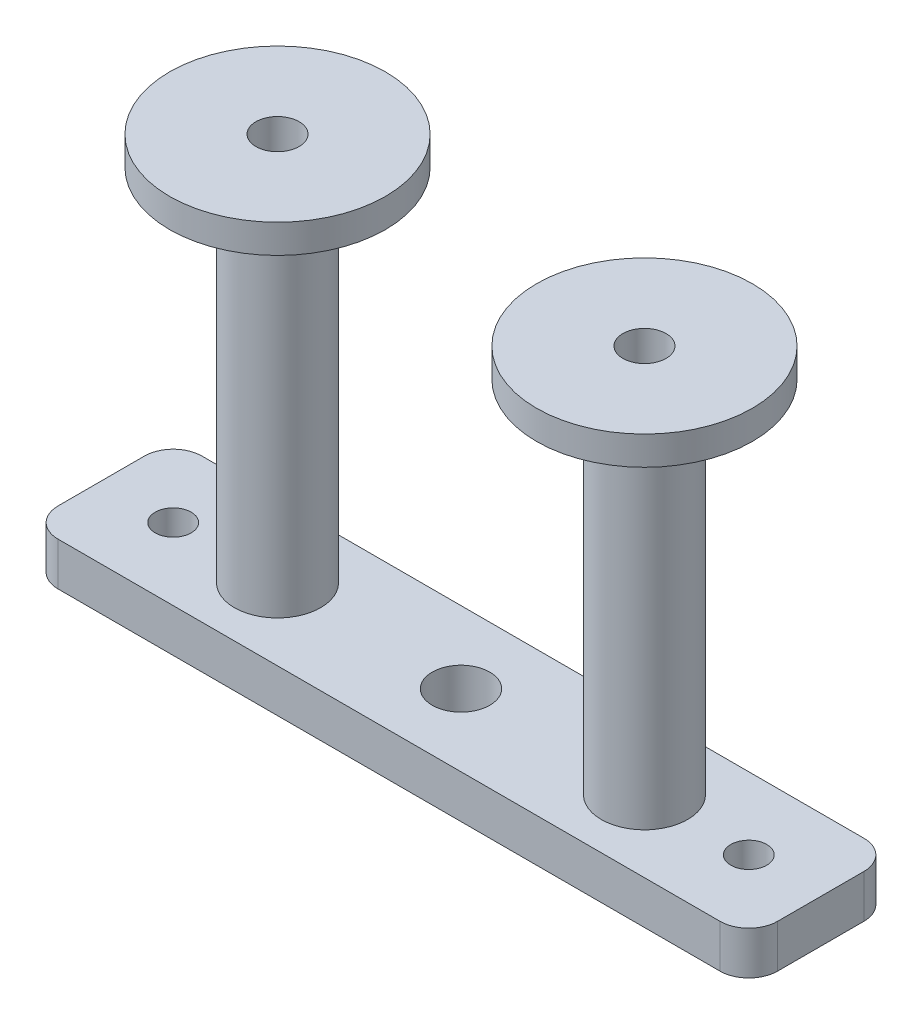
ISO-10303-21;
HEADER;
FILE_DESCRIPTION(('STEP AP214'),'2;1');
FILE_NAME('part.step','',(''),(''),'','','');
FILE_SCHEMA(('AUTOMOTIVE_DESIGN { 1 0 10303 214 1 1 1 1 }'));
ENDSEC;
DATA;
#1=APPLICATION_CONTEXT('core data for automotive mechanical design processes');
#2=APPLICATION_PROTOCOL_DEFINITION('international standard','automotive_design',2000,#1);
#3=PRODUCT_CONTEXT('',#1,'mechanical');
#4=PRODUCT('Part','Part','',(#3));
#5=PRODUCT_RELATED_PRODUCT_CATEGORY('part','',(#4));
#6=PRODUCT_DEFINITION_FORMATION('','',#4);
#7=PRODUCT_DEFINITION_CONTEXT('part definition',#1,'design');
#8=PRODUCT_DEFINITION('design','',#6,#7);
#9=PRODUCT_DEFINITION_SHAPE('','',#8);
#10=(LENGTH_UNIT() NAMED_UNIT(*) SI_UNIT(.MILLI.,.METRE.));
#11=(NAMED_UNIT(*) PLANE_ANGLE_UNIT() SI_UNIT($,.RADIAN.));
#12=(NAMED_UNIT(*) SI_UNIT($,.STERADIAN.) SOLID_ANGLE_UNIT());
#13=UNCERTAINTY_MEASURE_WITH_UNIT(LENGTH_MEASURE(1.E-05),#10,'distance_accuracy_value','');
#14=(GEOMETRIC_REPRESENTATION_CONTEXT(3) GLOBAL_UNCERTAINTY_ASSIGNED_CONTEXT((#13)) GLOBAL_UNIT_ASSIGNED_CONTEXT((#10,
#11,#12)) REPRESENTATION_CONTEXT('',''));
#15=CARTESIAN_POINT('',(0.,0.,0.));
#16=DIRECTION('',(0.,0.,1.));
#17=DIRECTION('',(1.,0.,0.));
#18=AXIS2_PLACEMENT_3D('',#15,#16,#17);
#19=CARTESIAN_POINT('',(2.,3.,-2.));
#20=DIRECTION('',(0.,-1.,0.));
#21=DIRECTION('',(0.,0.,-1.));
#22=AXIS2_PLACEMENT_3D('',#19,#20,#21);
#23=CYLINDRICAL_SURFACE('',#22,2.);
#24=CARTESIAN_POINT('',(2.,0.,-2.));
#25=DIRECTION('',(0.,1.,0.));
#26=DIRECTION('',(0.,0.,1.));
#27=AXIS2_PLACEMENT_3D('',#24,#25,#26);
#28=CIRCLE('',#27,2.);
#29=CARTESIAN_POINT('',(0.,0.,-2.00000000000001));
#30=VERTEX_POINT('',#29);
#31=CARTESIAN_POINT('',(2.00000000000001,0.,0.));
#32=VERTEX_POINT('',#31);
#33=EDGE_CURVE('E138',#30,#32,#28,.T.);
#34=ORIENTED_EDGE('',*,*,#33,.T.);
#35=DIRECTION('',(0.,-1.,0.));
#36=VECTOR('',#35,1.);
#37=CARTESIAN_POINT('',(2.00000000000001,3.,0.));
#38=LINE('',#37,#36);
#39=CARTESIAN_POINT('',(2.00000000000001,3.,0.));
#40=VERTEX_POINT('',#39);
#41=EDGE_CURVE('E12',#40,#32,#38,.T.);
#42=ORIENTED_EDGE('',*,*,#41,.F.);
#43=CARTESIAN_POINT('',(2.,3.,-2.));
#44=DIRECTION('',(0.,1.,0.));
#45=DIRECTION('',(0.,0.,1.));
#46=AXIS2_PLACEMENT_3D('',#43,#44,#45);
#47=CIRCLE('',#46,2.);
#48=CARTESIAN_POINT('',(0.,3.,-2.00000000000001));
#49=VERTEX_POINT('',#48);
#50=EDGE_CURVE('E153',#49,#40,#47,.T.);
#51=ORIENTED_EDGE('',*,*,#50,.F.);
#52=DIRECTION('',(0.,-1.,0.));
#53=VECTOR('',#52,1.);
#54=CARTESIAN_POINT('',(0.,3.,-2.00000000000001));
#55=LINE('',#54,#53);
#56=EDGE_CURVE('E134',#49,#30,#55,.T.);
#57=ORIENTED_EDGE('',*,*,#56,.T.);
#58=EDGE_LOOP('',(#34,#42,#51,#57));
#59=FACE_BOUND('',#58,.T.);
#60=ADVANCED_FACE('F42',(#59),#23,.T.);
#61=CARTESIAN_POINT('',(2.00000000000001,3.,0.));
#62=DIRECTION('',(0.,0.,-1.));
#63=DIRECTION('',(-1.,0.,0.));
#64=AXIS2_PLACEMENT_3D('',#61,#62,#63);
#65=PLANE('',#64);
#66=DIRECTION('',(1.,0.,0.));
#67=VECTOR('',#66,1.);
#68=CARTESIAN_POINT('',(2.00000000000001,0.,0.));
#69=LINE('',#68,#67);
#70=CARTESIAN_POINT('',(48.,0.,0.));
#71=VERTEX_POINT('',#70);
#72=EDGE_CURVE('E141',#32,#71,#69,.T.);
#73=ORIENTED_EDGE('',*,*,#72,.T.);
#74=DIRECTION('',(0.,-1.,0.));
#75=VECTOR('',#74,1.);
#76=CARTESIAN_POINT('',(48.,3.,0.));
#77=LINE('',#76,#75);
#78=CARTESIAN_POINT('',(48.,3.,0.));
#79=VERTEX_POINT('',#78);
#80=EDGE_CURVE('E50',#79,#71,#77,.T.);
#81=ORIENTED_EDGE('',*,*,#80,.F.);
#82=DIRECTION('',(1.,0.,0.));
#83=VECTOR('',#82,1.);
#84=CARTESIAN_POINT('',(2.00000000000001,3.,0.));
#85=LINE('',#84,#83);
#86=EDGE_CURVE('E101',#40,#79,#85,.T.);
#87=ORIENTED_EDGE('',*,*,#86,.F.);
#88=ORIENTED_EDGE('',*,*,#41,.T.);
#89=EDGE_LOOP('',(#73,#81,#87,#88));
#90=FACE_BOUND('',#89,.T.);
#91=ADVANCED_FACE('F272',(#90),#65,.F.);
#92=CARTESIAN_POINT('',(48.,3.,-2.));
#93=DIRECTION('',(0.,-1.,0.));
#94=DIRECTION('',(0.,0.,-1.));
#95=AXIS2_PLACEMENT_3D('',#92,#93,#94);
#96=CYLINDRICAL_SURFACE('',#95,2.);
#97=CARTESIAN_POINT('',(48.,0.,-2.));
#98=DIRECTION('',(0.,1.,0.));
#99=DIRECTION('',(0.,0.,1.));
#100=AXIS2_PLACEMENT_3D('',#97,#98,#99);
#101=CIRCLE('',#100,2.);
#102=CARTESIAN_POINT('',(50.,0.,-2.00000000000001));
#103=VERTEX_POINT('',#102);
#104=EDGE_CURVE('E144',#71,#103,#101,.T.);
#105=ORIENTED_EDGE('',*,*,#104,.T.);
#106=DIRECTION('',(0.,-1.,0.));
#107=VECTOR('',#106,1.);
#108=CARTESIAN_POINT('',(50.,3.,-2.00000000000001));
#109=LINE('',#108,#107);
#110=CARTESIAN_POINT('',(50.,3.,-2.00000000000001));
#111=VERTEX_POINT('',#110);
#112=EDGE_CURVE('E160',#111,#103,#109,.T.);
#113=ORIENTED_EDGE('',*,*,#112,.F.);
#114=CARTESIAN_POINT('',(48.,3.,-2.));
#115=DIRECTION('',(0.,1.,0.));
#116=DIRECTION('',(0.,0.,1.));
#117=AXIS2_PLACEMENT_3D('',#114,#115,#116);
#118=CIRCLE('',#117,2.);
#119=EDGE_CURVE('E168',#79,#111,#118,.T.);
#120=ORIENTED_EDGE('',*,*,#119,.F.);
#121=ORIENTED_EDGE('',*,*,#80,.T.);
#122=EDGE_LOOP('',(#105,#113,#120,#121));
#123=FACE_BOUND('',#122,.T.);
#124=ADVANCED_FACE('F166',(#123),#96,.T.);
#125=CARTESIAN_POINT('',(50.,3.,-2.00000000000001));
#126=DIRECTION('',(-1.,0.,0.));
#127=DIRECTION('',(0.,0.,1.));
#128=AXIS2_PLACEMENT_3D('',#125,#126,#127);
#129=PLANE('',#128);
#130=DIRECTION('',(0.,0.,-1.));
#131=VECTOR('',#130,1.);
#132=CARTESIAN_POINT('',(50.,0.,-2.00000000000001));
#133=LINE('',#132,#131);
#134=CARTESIAN_POINT('',(50.,0.,-7.99999999999999));
#135=VERTEX_POINT('',#134);
#136=EDGE_CURVE('E146',#103,#135,#133,.T.);
#137=ORIENTED_EDGE('',*,*,#136,.T.);
#138=DIRECTION('',(0.,-1.,0.));
#139=VECTOR('',#138,1.);
#140=CARTESIAN_POINT('',(50.,3.,-7.99999999999999));
#141=LINE('',#140,#139);
#142=CARTESIAN_POINT('',(50.,3.,-7.99999999999999));
#143=VERTEX_POINT('',#142);
#144=EDGE_CURVE('E157',#143,#135,#141,.T.);
#145=ORIENTED_EDGE('',*,*,#144,.F.);
#146=DIRECTION('',(0.,0.,-1.));
#147=VECTOR('',#146,1.);
#148=CARTESIAN_POINT('',(50.,3.,-2.00000000000001));
#149=LINE('',#148,#147);
#150=EDGE_CURVE('E180',#111,#143,#149,.T.);
#151=ORIENTED_EDGE('',*,*,#150,.F.);
#152=ORIENTED_EDGE('',*,*,#112,.T.);
#153=EDGE_LOOP('',(#137,#145,#151,#152));
#154=FACE_BOUND('',#153,.T.);
#155=ADVANCED_FACE('F176',(#154),#129,.F.);
#156=CARTESIAN_POINT('',(48.,3.,-8.));
#157=DIRECTION('',(0.,-1.,0.));
#158=DIRECTION('',(0.,0.,-1.));
#159=AXIS2_PLACEMENT_3D('',#156,#157,#158);
#160=CYLINDRICAL_SURFACE('',#159,2.);
#161=CARTESIAN_POINT('',(48.,0.,-8.));
#162=DIRECTION('',(0.,1.,0.));
#163=DIRECTION('',(0.,0.,-1.));
#164=AXIS2_PLACEMENT_3D('',#161,#162,#163);
#165=CIRCLE('',#164,2.);
#166=CARTESIAN_POINT('',(48.,0.,-10.));
#167=VERTEX_POINT('',#166);
#168=EDGE_CURVE('E148',#135,#167,#165,.T.);
#169=ORIENTED_EDGE('',*,*,#168,.T.);
#170=DIRECTION('',(0.,-1.,0.));
#171=VECTOR('',#170,1.);
#172=CARTESIAN_POINT('',(48.,3.,-10.));
#173=LINE('',#172,#171);
#174=CARTESIAN_POINT('',(48.,3.,-10.));
#175=VERTEX_POINT('',#174);
#176=EDGE_CURVE('E129',#175,#167,#173,.T.);
#177=ORIENTED_EDGE('',*,*,#176,.F.);
#178=CARTESIAN_POINT('',(48.,3.,-8.));
#179=DIRECTION('',(0.,1.,0.));
#180=DIRECTION('',(0.,0.,-1.));
#181=AXIS2_PLACEMENT_3D('',#178,#179,#180);
#182=CIRCLE('',#181,2.);
#183=EDGE_CURVE('E120',#143,#175,#182,.T.);
#184=ORIENTED_EDGE('',*,*,#183,.F.);
#185=ORIENTED_EDGE('',*,*,#144,.T.);
#186=EDGE_LOOP('',(#169,#177,#184,#185));
#187=FACE_BOUND('',#186,.T.);
#188=ADVANCED_FACE('F179',(#187),#160,.T.);
#189=CARTESIAN_POINT('',(2.00000000000001,3.,-10.));
#190=DIRECTION('',(0.,0.,1.));
#191=DIRECTION('',(1.,0.,0.));
#192=AXIS2_PLACEMENT_3D('',#189,#190,#191);
#193=PLANE('',#192);
#194=DIRECTION('',(-1.,0.,0.));
#195=VECTOR('',#194,1.);
#196=CARTESIAN_POINT('',(2.00000000000001,0.,-10.));
#197=LINE('',#196,#195);
#198=CARTESIAN_POINT('',(2.00000000000001,0.,-10.));
#199=VERTEX_POINT('',#198);
#200=EDGE_CURVE('E128',#167,#199,#197,.T.);
#201=ORIENTED_EDGE('',*,*,#200,.T.);
#202=DIRECTION('',(0.,-1.,0.));
#203=VECTOR('',#202,1.);
#204=CARTESIAN_POINT('',(2.00000000000001,3.,-10.));
#205=LINE('',#204,#203);
#206=CARTESIAN_POINT('',(2.00000000000001,3.,-10.));
#207=VERTEX_POINT('',#206);
#208=EDGE_CURVE('E125',#207,#199,#205,.T.);
#209=ORIENTED_EDGE('',*,*,#208,.F.);
#210=DIRECTION('',(-1.,0.,0.));
#211=VECTOR('',#210,1.);
#212=CARTESIAN_POINT('',(2.00000000000001,3.,-10.));
#213=LINE('',#212,#211);
#214=EDGE_CURVE('E114',#175,#207,#213,.T.);
#215=ORIENTED_EDGE('',*,*,#214,.F.);
#216=ORIENTED_EDGE('',*,*,#176,.T.);
#217=EDGE_LOOP('',(#201,#209,#215,#216));
#218=FACE_BOUND('',#217,.T.);
#219=ADVANCED_FACE('F126',(#218),#193,.F.);
#220=CARTESIAN_POINT('',(2.,3.,-8.));
#221=DIRECTION('',(0.,-1.,0.));
#222=DIRECTION('',(0.,0.,-1.));
#223=AXIS2_PLACEMENT_3D('',#220,#221,#222);
#224=CYLINDRICAL_SURFACE('',#223,2.);
#225=CARTESIAN_POINT('',(2.,0.,-8.));
#226=DIRECTION('',(0.,1.,0.));
#227=DIRECTION('',(0.,0.,1.));
#228=AXIS2_PLACEMENT_3D('',#225,#226,#227);
#229=CIRCLE('',#228,2.);
#230=CARTESIAN_POINT('',(0.,0.,-7.99999999999999));
#231=VERTEX_POINT('',#230);
#232=EDGE_CURVE('E87',#199,#231,#229,.T.);
#233=ORIENTED_EDGE('',*,*,#232,.T.);
#234=DIRECTION('',(0.,-1.,0.));
#235=VECTOR('',#234,1.);
#236=CARTESIAN_POINT('',(0.,3.,-7.99999999999999));
#237=LINE('',#236,#235);
#238=CARTESIAN_POINT('',(0.,3.,-7.99999999999999));
#239=VERTEX_POINT('',#238);
#240=EDGE_CURVE('E130',#239,#231,#237,.T.);
#241=ORIENTED_EDGE('',*,*,#240,.F.);
#242=CARTESIAN_POINT('',(2.,3.,-8.));
#243=DIRECTION('',(0.,1.,0.));
#244=DIRECTION('',(0.,0.,1.));
#245=AXIS2_PLACEMENT_3D('',#242,#243,#244);
#246=CIRCLE('',#245,2.);
#247=EDGE_CURVE('E118',#207,#239,#246,.T.);
#248=ORIENTED_EDGE('',*,*,#247,.F.);
#249=ORIENTED_EDGE('',*,*,#208,.T.);
#250=EDGE_LOOP('',(#233,#241,#248,#249));
#251=FACE_BOUND('',#250,.T.);
#252=ADVANCED_FACE('F132',(#251),#224,.T.);
#253=CARTESIAN_POINT('',(0.,3.,-2.00000000000001));
#254=DIRECTION('',(1.,0.,0.));
#255=DIRECTION('',(0.,0.,-1.));
#256=AXIS2_PLACEMENT_3D('',#253,#254,#255);
#257=PLANE('',#256);
#258=DIRECTION('',(0.,0.,1.));
#259=VECTOR('',#258,1.);
#260=CARTESIAN_POINT('',(0.,0.,-2.00000000000001));
#261=LINE('',#260,#259);
#262=EDGE_CURVE('E93',#231,#30,#261,.T.);
#263=ORIENTED_EDGE('',*,*,#262,.T.);
#264=ORIENTED_EDGE('',*,*,#56,.F.);
#265=DIRECTION('',(0.,0.,1.));
#266=VECTOR('',#265,1.);
#267=CARTESIAN_POINT('',(0.,3.,-2.00000000000001));
#268=LINE('',#267,#266);
#269=EDGE_CURVE('E58',#239,#49,#268,.T.);
#270=ORIENTED_EDGE('',*,*,#269,.F.);
#271=ORIENTED_EDGE('',*,*,#240,.T.);
#272=EDGE_LOOP('',(#263,#264,#270,#271));
#273=FACE_BOUND('',#272,.T.);
#274=ADVANCED_FACE('F261',(#273),#257,.F.);
#275=CARTESIAN_POINT('',(2.,3.,-2.));
#276=DIRECTION('',(0.,1.,0.));
#277=DIRECTION('',(0.,0.,1.));
#278=AXIS2_PLACEMENT_3D('',#275,#276,#277);
#279=PLANE('',#278);
#280=CARTESIAN_POINT('',(25.,3.,-5.));
#281=DIRECTION('',(0.,1.,0.));
#282=DIRECTION('',(0.,0.,1.));
#283=AXIS2_PLACEMENT_3D('',#280,#281,#282);
#284=CIRCLE('',#283,2.);
#285=CARTESIAN_POINT('',(25.,3.,-3.));
#286=VERTEX_POINT('',#285);
#287=EDGE_CURVE('E233',#286,#286,#284,.T.);
#288=ORIENTED_EDGE('',*,*,#287,.F.);
#289=EDGE_LOOP('',(#288));
#290=FACE_BOUND('',#289,.T.);
#291=CARTESIAN_POINT('',(37.75,3.,-5.));
#292=DIRECTION('',(0.,1.,0.));
#293=DIRECTION('',(0.,0.,1.));
#294=AXIS2_PLACEMENT_3D('',#291,#292,#293);
#295=CIRCLE('',#294,3.);
#296=CARTESIAN_POINT('',(37.75,3.,-2.));
#297=VERTEX_POINT('',#296);
#298=EDGE_CURVE('E204',#297,#297,#295,.T.);
#299=ORIENTED_EDGE('',*,*,#298,.F.);
#300=EDGE_LOOP('',(#299));
#301=FACE_BOUND('',#300,.T.);
#302=CARTESIAN_POINT('',(12.25,3.,-5.));
#303=DIRECTION('',(0.,1.,0.));
#304=DIRECTION('',(0.,0.,1.));
#305=AXIS2_PLACEMENT_3D('',#302,#303,#304);
#306=CIRCLE('',#305,3.);
#307=CARTESIAN_POINT('',(12.25,3.,-2.));
#308=VERTEX_POINT('',#307);
#309=EDGE_CURVE('E198',#308,#308,#306,.T.);
#310=ORIENTED_EDGE('',*,*,#309,.F.);
#311=EDGE_LOOP('',(#310));
#312=FACE_BOUND('',#311,.T.);
#313=CARTESIAN_POINT('',(5.,3.,-5.));
#314=DIRECTION('',(0.,1.,0.));
#315=DIRECTION('',(0.,0.,1.));
#316=AXIS2_PLACEMENT_3D('',#313,#314,#315);
#317=CIRCLE('',#316,1.25);
#318=CARTESIAN_POINT('',(5.,3.,-3.75));
#319=VERTEX_POINT('',#318);
#320=EDGE_CURVE('E193',#319,#319,#317,.T.);
#321=ORIENTED_EDGE('',*,*,#320,.F.);
#322=EDGE_LOOP('',(#321));
#323=FACE_BOUND('',#322,.T.);
#324=CARTESIAN_POINT('',(45.,3.,-5.));
#325=DIRECTION('',(0.,1.,0.));
#326=DIRECTION('',(0.,0.,1.));
#327=AXIS2_PLACEMENT_3D('',#324,#325,#326);
#328=CIRCLE('',#327,1.25);
#329=CARTESIAN_POINT('',(45.,3.,-3.74999999999999));
#330=VERTEX_POINT('',#329);
#331=EDGE_CURVE('E186',#330,#330,#328,.T.);
#332=ORIENTED_EDGE('',*,*,#331,.F.);
#333=EDGE_LOOP('',(#332));
#334=FACE_BOUND('',#333,.T.);
#335=ORIENTED_EDGE('',*,*,#50,.T.);
#336=ORIENTED_EDGE('',*,*,#86,.T.);
#337=ORIENTED_EDGE('',*,*,#119,.T.);
#338=ORIENTED_EDGE('',*,*,#150,.T.);
#339=ORIENTED_EDGE('',*,*,#183,.T.);
#340=ORIENTED_EDGE('',*,*,#214,.T.);
#341=ORIENTED_EDGE('',*,*,#247,.T.);
#342=ORIENTED_EDGE('',*,*,#269,.T.);
#343=EDGE_LOOP('',(#335,#336,#337,#338,#339,#340,#341,#342));
#344=FACE_BOUND('',#343,.T.);
#345=ADVANCED_FACE('F116',(#290,#301,#312,#323,#334,#344),#279,.T.);
#346=CARTESIAN_POINT('',(2.,0.,-2.));
#347=DIRECTION('',(0.,1.,0.));
#348=DIRECTION('',(0.,0.,1.));
#349=AXIS2_PLACEMENT_3D('',#346,#347,#348);
#350=PLANE('',#349);
#351=CARTESIAN_POINT('',(25.,0.,-5.));
#352=DIRECTION('',(0.,-1.,0.));
#353=DIRECTION('',(0.,0.,-1.));
#354=AXIS2_PLACEMENT_3D('',#351,#352,#353);
#355=CIRCLE('',#354,2.);
#356=CARTESIAN_POINT('',(25.,0.,-7.));
#357=VERTEX_POINT('',#356);
#358=EDGE_CURVE('E236',#357,#357,#355,.T.);
#359=ORIENTED_EDGE('',*,*,#358,.F.);
#360=EDGE_LOOP('',(#359));
#361=FACE_BOUND('',#360,.T.);
#362=CARTESIAN_POINT('',(37.75,0.,-5.));
#363=DIRECTION('',(0.,1.,0.));
#364=DIRECTION('',(0.,0.,1.));
#365=AXIS2_PLACEMENT_3D('',#362,#363,#364);
#366=CIRCLE('',#365,1.5);
#367=CARTESIAN_POINT('',(37.75,0.,-3.5));
#368=VERTEX_POINT('',#367);
#369=EDGE_CURVE('E225',#368,#368,#366,.T.);
#370=ORIENTED_EDGE('',*,*,#369,.T.);
#371=EDGE_LOOP('',(#370));
#372=FACE_BOUND('',#371,.T.);
#373=CARTESIAN_POINT('',(12.25,0.,-5.));
#374=DIRECTION('',(0.,1.,0.));
#375=DIRECTION('',(0.,0.,1.));
#376=AXIS2_PLACEMENT_3D('',#373,#374,#375);
#377=CIRCLE('',#376,1.5);
#378=CARTESIAN_POINT('',(12.25,0.,-3.5));
#379=VERTEX_POINT('',#378);
#380=EDGE_CURVE('E213',#379,#379,#377,.T.);
#381=ORIENTED_EDGE('',*,*,#380,.T.);
#382=EDGE_LOOP('',(#381));
#383=FACE_BOUND('',#382,.T.);
#384=CARTESIAN_POINT('',(5.,0.,-5.));
#385=DIRECTION('',(0.,1.,0.));
#386=DIRECTION('',(0.,0.,1.));
#387=AXIS2_PLACEMENT_3D('',#384,#385,#386);
#388=CIRCLE('',#387,1.25);
#389=CARTESIAN_POINT('',(5.,0.,-3.75));
#390=VERTEX_POINT('',#389);
#391=EDGE_CURVE('E142',#390,#390,#388,.T.);
#392=ORIENTED_EDGE('',*,*,#391,.T.);
#393=EDGE_LOOP('',(#392));
#394=FACE_BOUND('',#393,.T.);
#395=CARTESIAN_POINT('',(45.,0.,-5.));
#396=DIRECTION('',(0.,1.,0.));
#397=DIRECTION('',(0.,0.,1.));
#398=AXIS2_PLACEMENT_3D('',#395,#396,#397);
#399=CIRCLE('',#398,1.25);
#400=CARTESIAN_POINT('',(45.,0.,-3.74999999999999));
#401=VERTEX_POINT('',#400);
#402=EDGE_CURVE('E189',#401,#401,#399,.T.);
#403=ORIENTED_EDGE('',*,*,#402,.T.);
#404=EDGE_LOOP('',(#403));
#405=FACE_BOUND('',#404,.T.);
#406=ORIENTED_EDGE('',*,*,#33,.F.);
#407=ORIENTED_EDGE('',*,*,#262,.F.);
#408=ORIENTED_EDGE('',*,*,#232,.F.);
#409=ORIENTED_EDGE('',*,*,#200,.F.);
#410=ORIENTED_EDGE('',*,*,#168,.F.);
#411=ORIENTED_EDGE('',*,*,#136,.F.);
#412=ORIENTED_EDGE('',*,*,#104,.F.);
#413=ORIENTED_EDGE('',*,*,#72,.F.);
#414=EDGE_LOOP('',(#406,#407,#408,#409,#410,#411,#412,#413));
#415=FACE_BOUND('',#414,.T.);
#416=ADVANCED_FACE('F172',(#361,#372,#383,#394,#405,#415),#350,.F.);
#417=CARTESIAN_POINT('',(45.,0.,-5.));
#418=DIRECTION('',(0.,1.,0.));
#419=DIRECTION('',(0.,0.,1.));
#420=AXIS2_PLACEMENT_3D('',#417,#418,#419);
#421=CYLINDRICAL_SURFACE('',#420,1.25);
#422=ORIENTED_EDGE('',*,*,#402,.F.);
#423=EDGE_LOOP('',(#422));
#424=FACE_BOUND('',#423,.T.);
#425=ORIENTED_EDGE('',*,*,#331,.T.);
#426=EDGE_LOOP('',(#425));
#427=FACE_BOUND('',#426,.T.);
#428=ADVANCED_FACE('F244',(#424,#427),#421,.F.);
#429=CARTESIAN_POINT('',(5.,0.,-5.));
#430=DIRECTION('',(0.,1.,0.));
#431=DIRECTION('',(0.,0.,1.));
#432=AXIS2_PLACEMENT_3D('',#429,#430,#431);
#433=CYLINDRICAL_SURFACE('',#432,1.25);
#434=ORIENTED_EDGE('',*,*,#391,.F.);
#435=EDGE_LOOP('',(#434));
#436=FACE_BOUND('',#435,.T.);
#437=ORIENTED_EDGE('',*,*,#320,.T.);
#438=EDGE_LOOP('',(#437));
#439=FACE_BOUND('',#438,.T.);
#440=ADVANCED_FACE('F256',(#436,#439),#433,.F.);
#441=CARTESIAN_POINT('',(12.25,28.,-5.));
#442=DIRECTION('',(0.,-1.,0.));
#443=DIRECTION('',(0.,0.,-1.));
#444=AXIS2_PLACEMENT_3D('',#441,#442,#443);
#445=CYLINDRICAL_SURFACE('',#444,3.);
#446=CARTESIAN_POINT('',(12.25,28.,-5.));
#447=DIRECTION('',(0.,1.,0.));
#448=DIRECTION('',(0.,0.,1.));
#449=AXIS2_PLACEMENT_3D('',#446,#447,#448);
#450=CIRCLE('',#449,3.);
#451=CARTESIAN_POINT('',(12.25,28.,-2.));
#452=VERTEX_POINT('',#451);
#453=EDGE_CURVE('E190',#452,#452,#450,.T.);
#454=ORIENTED_EDGE('',*,*,#453,.F.);
#455=EDGE_LOOP('',(#454));
#456=FACE_BOUND('',#455,.T.);
#457=ORIENTED_EDGE('',*,*,#309,.T.);
#458=EDGE_LOOP('',(#457));
#459=FACE_BOUND('',#458,.T.);
#460=ADVANCED_FACE('F313',(#456,#459),#445,.T.);
#461=CARTESIAN_POINT('',(37.75,28.,-5.));
#462=DIRECTION('',(0.,-1.,0.));
#463=DIRECTION('',(0.,0.,-1.));
#464=AXIS2_PLACEMENT_3D('',#461,#462,#463);
#465=CYLINDRICAL_SURFACE('',#464,3.);
#466=CARTESIAN_POINT('',(37.75,28.,-5.));
#467=DIRECTION('',(0.,1.,0.));
#468=DIRECTION('',(0.,0.,1.));
#469=AXIS2_PLACEMENT_3D('',#466,#467,#468);
#470=CIRCLE('',#469,3.);
#471=CARTESIAN_POINT('',(37.75,28.,-2.));
#472=VERTEX_POINT('',#471);
#473=EDGE_CURVE('E201',#472,#472,#470,.T.);
#474=ORIENTED_EDGE('',*,*,#473,.F.);
#475=EDGE_LOOP('',(#474));
#476=FACE_BOUND('',#475,.T.);
#477=ORIENTED_EDGE('',*,*,#298,.T.);
#478=EDGE_LOOP('',(#477));
#479=FACE_BOUND('',#478,.T.);
#480=ADVANCED_FACE('F322',(#476,#479),#465,.T.);
#481=CARTESIAN_POINT('',(12.25,30.,-5.));
#482=DIRECTION('',(0.,-1.,0.));
#483=DIRECTION('',(0.,0.,-1.));
#484=AXIS2_PLACEMENT_3D('',#481,#482,#483);
#485=CYLINDRICAL_SURFACE('',#484,7.5);
#486=CARTESIAN_POINT('',(12.25,30.,-5.));
#487=DIRECTION('',(0.,1.,0.));
#488=DIRECTION('',(0.,0.,1.));
#489=AXIS2_PLACEMENT_3D('',#486,#487,#488);
#490=CIRCLE('',#489,7.5);
#491=CARTESIAN_POINT('',(12.25,30.,2.5));
#492=VERTEX_POINT('',#491);
#493=EDGE_CURVE('E207',#492,#492,#490,.T.);
#494=ORIENTED_EDGE('',*,*,#493,.F.);
#495=EDGE_LOOP('',(#494));
#496=FACE_BOUND('',#495,.T.);
#497=CARTESIAN_POINT('',(12.25,28.,-5.));
#498=DIRECTION('',(0.,1.,0.));
#499=DIRECTION('',(0.,0.,1.));
#500=AXIS2_PLACEMENT_3D('',#497,#498,#499);
#501=CIRCLE('',#500,7.5);
#502=CARTESIAN_POINT('',(12.25,28.,2.5));
#503=VERTEX_POINT('',#502);
#504=EDGE_CURVE('E210',#503,#503,#501,.T.);
#505=ORIENTED_EDGE('',*,*,#504,.T.);
#506=EDGE_LOOP('',(#505));
#507=FACE_BOUND('',#506,.T.);
#508=ADVANCED_FACE('F331',(#496,#507),#485,.T.);
#509=CARTESIAN_POINT('',(12.25,30.,-5.));
#510=DIRECTION('',(0.,1.,0.));
#511=DIRECTION('',(0.,0.,1.));
#512=AXIS2_PLACEMENT_3D('',#509,#510,#511);
#513=PLANE('',#512);
#514=CARTESIAN_POINT('',(12.25,30.,-5.));
#515=DIRECTION('',(0.,1.,0.));
#516=DIRECTION('',(0.,0.,1.));
#517=AXIS2_PLACEMENT_3D('',#514,#515,#516);
#518=CIRCLE('',#517,1.5);
#519=CARTESIAN_POINT('',(12.25,30.,-3.5));
#520=VERTEX_POINT('',#519);
#521=EDGE_CURVE('E218',#520,#520,#518,.T.);
#522=ORIENTED_EDGE('',*,*,#521,.F.);
#523=EDGE_LOOP('',(#522));
#524=FACE_BOUND('',#523,.T.);
#525=ORIENTED_EDGE('',*,*,#493,.T.);
#526=EDGE_LOOP('',(#525));
#527=FACE_BOUND('',#526,.T.);
#528=ADVANCED_FACE('F340',(#524,#527),#513,.T.);
#529=CARTESIAN_POINT('',(12.25,28.,-5.));
#530=DIRECTION('',(0.,1.,0.));
#531=DIRECTION('',(0.,0.,1.));
#532=AXIS2_PLACEMENT_3D('',#529,#530,#531);
#533=PLANE('',#532);
#534=ORIENTED_EDGE('',*,*,#453,.T.);
#535=EDGE_LOOP('',(#534));
#536=FACE_BOUND('',#535,.T.);
#537=ORIENTED_EDGE('',*,*,#504,.F.);
#538=EDGE_LOOP('',(#537));
#539=FACE_BOUND('',#538,.T.);
#540=ADVANCED_FACE('F347',(#536,#539),#533,.F.);
#541=CARTESIAN_POINT('',(12.25,-32.,-5.));
#542=DIRECTION('',(0.,1.,0.));
#543=DIRECTION('',(0.,0.,1.));
#544=AXIS2_PLACEMENT_3D('',#541,#542,#543);
#545=CYLINDRICAL_SURFACE('',#544,1.5);
#546=ORIENTED_EDGE('',*,*,#521,.T.);
#547=EDGE_LOOP('',(#546));
#548=FACE_BOUND('',#547,.T.);
#549=ORIENTED_EDGE('',*,*,#380,.F.);
#550=EDGE_LOOP('',(#549));
#551=FACE_BOUND('',#550,.T.);
#552=ADVANCED_FACE('F351',(#548,#551),#545,.F.);
#553=CARTESIAN_POINT('',(37.75,30.,-5.));
#554=DIRECTION('',(0.,-1.,0.));
#555=DIRECTION('',(0.,0.,-1.));
#556=AXIS2_PLACEMENT_3D('',#553,#554,#555);
#557=CYLINDRICAL_SURFACE('',#556,7.5);
#558=CARTESIAN_POINT('',(37.75,30.,-5.));
#559=DIRECTION('',(0.,1.,0.));
#560=DIRECTION('',(0.,0.,1.));
#561=AXIS2_PLACEMENT_3D('',#558,#559,#560);
#562=CIRCLE('',#561,7.5);
#563=CARTESIAN_POINT('',(37.75,30.,2.5));
#564=VERTEX_POINT('',#563);
#565=EDGE_CURVE('E221',#564,#564,#562,.T.);
#566=ORIENTED_EDGE('',*,*,#565,.F.);
#567=EDGE_LOOP('',(#566));
#568=FACE_BOUND('',#567,.T.);
#569=CARTESIAN_POINT('',(37.75,28.,-5.));
#570=DIRECTION('',(0.,1.,0.));
#571=DIRECTION('',(0.,0.,1.));
#572=AXIS2_PLACEMENT_3D('',#569,#570,#571);
#573=CIRCLE('',#572,7.5);
#574=CARTESIAN_POINT('',(37.75,28.,2.5));
#575=VERTEX_POINT('',#574);
#576=EDGE_CURVE('E222',#575,#575,#573,.T.);
#577=ORIENTED_EDGE('',*,*,#576,.T.);
#578=EDGE_LOOP('',(#577));
#579=FACE_BOUND('',#578,.T.);
#580=ADVANCED_FACE('F367',(#568,#579),#557,.T.);
#581=CARTESIAN_POINT('',(37.75,30.,-5.));
#582=DIRECTION('',(0.,1.,0.));
#583=DIRECTION('',(0.,0.,1.));
#584=AXIS2_PLACEMENT_3D('',#581,#582,#583);
#585=PLANE('',#584);
#586=CARTESIAN_POINT('',(37.75,30.,-5.));
#587=DIRECTION('',(0.,1.,0.));
#588=DIRECTION('',(0.,0.,1.));
#589=AXIS2_PLACEMENT_3D('',#586,#587,#588);
#590=CIRCLE('',#589,1.5);
#591=CARTESIAN_POINT('',(37.75,30.,-3.5));
#592=VERTEX_POINT('',#591);
#593=EDGE_CURVE('E230',#592,#592,#590,.T.);
#594=ORIENTED_EDGE('',*,*,#593,.F.);
#595=EDGE_LOOP('',(#594));
#596=FACE_BOUND('',#595,.T.);
#597=ORIENTED_EDGE('',*,*,#565,.T.);
#598=EDGE_LOOP('',(#597));
#599=FACE_BOUND('',#598,.T.);
#600=ADVANCED_FACE('F376',(#596,#599),#585,.T.);
#601=CARTESIAN_POINT('',(37.75,28.,-5.));
#602=DIRECTION('',(0.,1.,0.));
#603=DIRECTION('',(0.,0.,1.));
#604=AXIS2_PLACEMENT_3D('',#601,#602,#603);
#605=PLANE('',#604);
#606=ORIENTED_EDGE('',*,*,#473,.T.);
#607=EDGE_LOOP('',(#606));
#608=FACE_BOUND('',#607,.T.);
#609=ORIENTED_EDGE('',*,*,#576,.F.);
#610=EDGE_LOOP('',(#609));
#611=FACE_BOUND('',#610,.T.);
#612=ADVANCED_FACE('F383',(#608,#611),#605,.F.);
#613=CARTESIAN_POINT('',(37.75,-22.,-5.));
#614=DIRECTION('',(0.,1.,0.));
#615=DIRECTION('',(0.,0.,1.));
#616=AXIS2_PLACEMENT_3D('',#613,#614,#615);
#617=CYLINDRICAL_SURFACE('',#616,1.5);
#618=ORIENTED_EDGE('',*,*,#593,.T.);
#619=EDGE_LOOP('',(#618));
#620=FACE_BOUND('',#619,.T.);
#621=ORIENTED_EDGE('',*,*,#369,.F.);
#622=EDGE_LOOP('',(#621));
#623=FACE_BOUND('',#622,.T.);
#624=ADVANCED_FACE('F387',(#620,#623),#617,.F.);
#625=CARTESIAN_POINT('',(25.,22.,-5.));
#626=DIRECTION('',(0.,-1.,0.));
#627=DIRECTION('',(0.,0.,-1.));
#628=AXIS2_PLACEMENT_3D('',#625,#626,#627);
#629=CYLINDRICAL_SURFACE('',#628,2.);
#630=ORIENTED_EDGE('',*,*,#287,.T.);
#631=EDGE_LOOP('',(#630));
#632=FACE_BOUND('',#631,.T.);
#633=ORIENTED_EDGE('',*,*,#358,.T.);
#634=EDGE_LOOP('',(#633));
#635=FACE_BOUND('',#634,.T.);
#636=ADVANCED_FACE('F240',(#632,#635),#629,.F.);
#637=CLOSED_SHELL('',(#60,#91,#124,#155,#188,#219,#252,#274,#345,#416,#428,#440,#460,#480,#508,
#528,#540,#552,#580,#600,#612,#624,#636));
#638=MANIFOLD_SOLID_BREP('B2',#637);
#639=ADVANCED_BREP_SHAPE_REPRESENTATION('',(#18,#638),#14);
#640=SHAPE_DEFINITION_REPRESENTATION(#9,#639);
ENDSEC;
END-ISO-10303-21;
